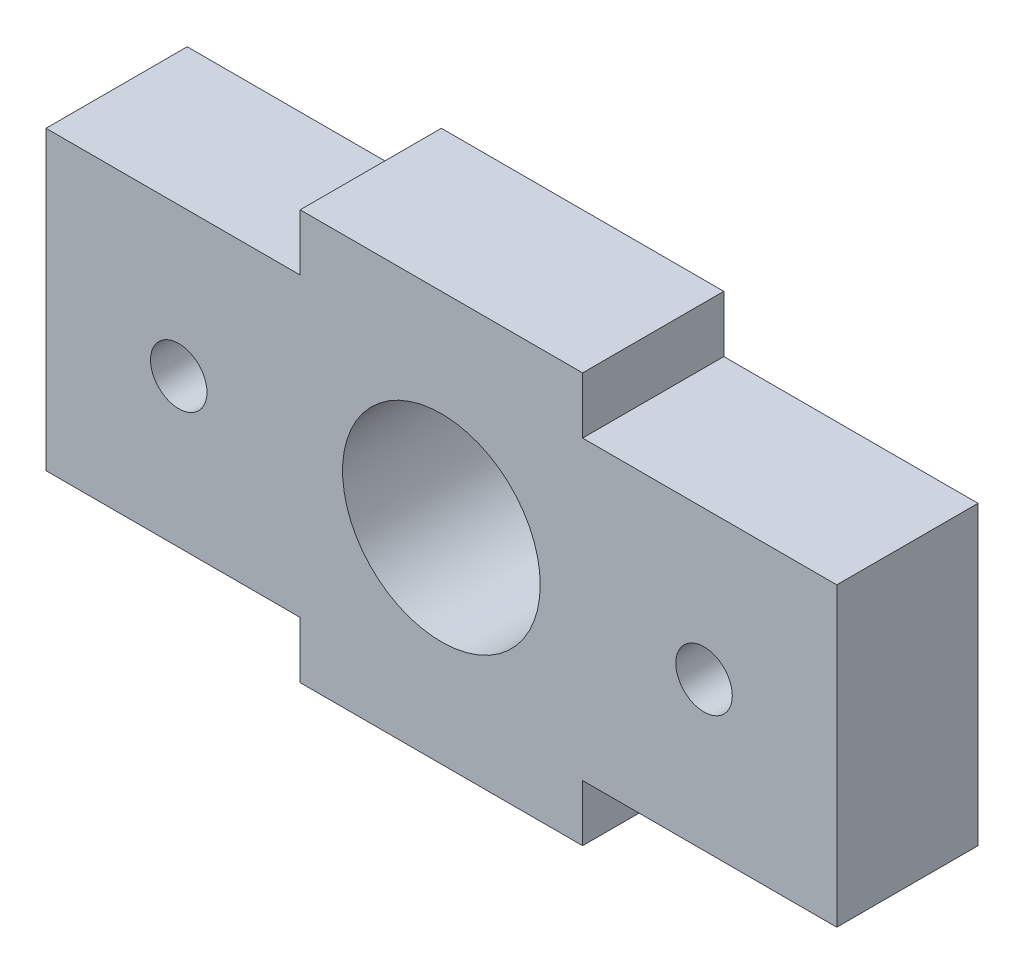
ISO-10303-21;
HEADER;
FILE_DESCRIPTION(('STEP AP214'),'2;1');
FILE_NAME('part.step','',(''),(''),'','','');
FILE_SCHEMA(('AUTOMOTIVE_DESIGN { 1 0 10303 214 1 1 1 1 }'));
ENDSEC;
DATA;
#1=APPLICATION_CONTEXT('core data for automotive mechanical design processes');
#2=APPLICATION_PROTOCOL_DEFINITION('international standard','automotive_design',2000,#1);
#3=PRODUCT_CONTEXT('',#1,'mechanical');
#4=PRODUCT('Part','Part','',(#3));
#5=PRODUCT_RELATED_PRODUCT_CATEGORY('part','',(#4));
#6=PRODUCT_DEFINITION_FORMATION('','',#4);
#7=PRODUCT_DEFINITION_CONTEXT('part definition',#1,'design');
#8=PRODUCT_DEFINITION('design','',#6,#7);
#9=PRODUCT_DEFINITION_SHAPE('','',#8);
#10=(LENGTH_UNIT() NAMED_UNIT(*) SI_UNIT(.MILLI.,.METRE.));
#11=(NAMED_UNIT(*) PLANE_ANGLE_UNIT() SI_UNIT($,.RADIAN.));
#12=(NAMED_UNIT(*) SI_UNIT($,.STERADIAN.) SOLID_ANGLE_UNIT());
#13=UNCERTAINTY_MEASURE_WITH_UNIT(LENGTH_MEASURE(1.E-05),#10,'distance_accuracy_value','');
#14=(GEOMETRIC_REPRESENTATION_CONTEXT(3) GLOBAL_UNCERTAINTY_ASSIGNED_CONTEXT((#13)) GLOBAL_UNIT_ASSIGNED_CONTEXT((#10,
#11,#12)) REPRESENTATION_CONTEXT('',''));
#15=CARTESIAN_POINT('',(0.,0.,0.));
#16=DIRECTION('',(0.,0.,1.));
#17=DIRECTION('',(1.,0.,0.));
#18=AXIS2_PLACEMENT_3D('',#15,#16,#17);
#19=CARTESIAN_POINT('',(0.,-5.25,5.));
#20=DIRECTION('',(0.,1.,0.));
#21=DIRECTION('',(-1.,0.,0.));
#22=AXIS2_PLACEMENT_3D('',#19,#20,#21);
#23=PLANE('',#22);
#24=DIRECTION('',(1.,0.,0.));
#25=VECTOR('',#24,1.);
#26=CARTESIAN_POINT('',(0.,-5.25,0.));
#27=LINE('',#26,#25);
#28=CARTESIAN_POINT('',(-14.,-5.25,0.));
#29=VERTEX_POINT('',#28);
#30=CARTESIAN_POINT('',(-5.,-5.25,0.));
#31=VERTEX_POINT('',#30);
#32=EDGE_CURVE('E223',#29,#31,#27,.T.);
#33=ORIENTED_EDGE('',*,*,#32,.T.);
#34=DIRECTION('',(0.,0.,-1.));
#35=VECTOR('',#34,1.);
#36=CARTESIAN_POINT('',(-5.,-5.25,5.));
#37=LINE('',#36,#35);
#38=CARTESIAN_POINT('',(-5.,-5.25,5.));
#39=VERTEX_POINT('',#38);
#40=EDGE_CURVE('E11',#39,#31,#37,.T.);
#41=ORIENTED_EDGE('',*,*,#40,.F.);
#42=DIRECTION('',(1.,0.,0.));
#43=VECTOR('',#42,1.);
#44=CARTESIAN_POINT('',(0.,-5.25,5.));
#45=LINE('',#44,#43);
#46=CARTESIAN_POINT('',(-14.,-5.25,5.));
#47=VERTEX_POINT('',#46);
#48=EDGE_CURVE('E171',#47,#39,#45,.T.);
#49=ORIENTED_EDGE('',*,*,#48,.F.);
#50=DIRECTION('',(0.,0.,-1.));
#51=VECTOR('',#50,1.);
#52=CARTESIAN_POINT('',(-14.,-5.25,5.));
#53=LINE('',#52,#51);
#54=EDGE_CURVE('E52',#47,#29,#53,.T.);
#55=ORIENTED_EDGE('',*,*,#54,.T.);
#56=EDGE_LOOP('',(#33,#41,#49,#55));
#57=FACE_BOUND('',#56,.T.);
#58=ADVANCED_FACE('F35',(#57),#23,.F.);
#59=CARTESIAN_POINT('',(-4.99999999999992,0.,5.));
#60=DIRECTION('',(1.,0.,0.));
#61=DIRECTION('',(0.,1.,0.));
#62=AXIS2_PLACEMENT_3D('',#59,#60,#61);
#63=PLANE('',#62);
#64=DIRECTION('',(0.,-1.,0.));
#65=VECTOR('',#64,1.);
#66=CARTESIAN_POINT('',(-4.99999999999992,0.,0.));
#67=LINE('',#66,#65);
#68=CARTESIAN_POINT('',(-5.00000000000001,-7.25,0.));
#69=VERTEX_POINT('',#68);
#70=EDGE_CURVE('E217',#31,#69,#67,.T.);
#71=ORIENTED_EDGE('',*,*,#70,.T.);
#72=DIRECTION('',(0.,0.,-1.));
#73=VECTOR('',#72,1.);
#74=CARTESIAN_POINT('',(-5.00000000000001,-7.25,5.));
#75=LINE('',#74,#73);
#76=CARTESIAN_POINT('',(-5.00000000000001,-7.25,5.));
#77=VERTEX_POINT('',#76);
#78=EDGE_CURVE('E44',#77,#69,#75,.T.);
#79=ORIENTED_EDGE('',*,*,#78,.F.);
#80=DIRECTION('',(0.,-1.,0.));
#81=VECTOR('',#80,1.);
#82=CARTESIAN_POINT('',(-4.99999999999992,0.,5.));
#83=LINE('',#82,#81);
#84=EDGE_CURVE('E102',#39,#77,#83,.T.);
#85=ORIENTED_EDGE('',*,*,#84,.F.);
#86=ORIENTED_EDGE('',*,*,#40,.T.);
#87=EDGE_LOOP('',(#71,#79,#85,#86));
#88=FACE_BOUND('',#87,.T.);
#89=ADVANCED_FACE('F37',(#88),#63,.F.);
#90=CARTESIAN_POINT('',(0.,-7.25,5.));
#91=DIRECTION('',(0.,1.,0.));
#92=DIRECTION('',(-1.,0.,0.));
#93=AXIS2_PLACEMENT_3D('',#90,#91,#92);
#94=PLANE('',#93);
#95=DIRECTION('',(1.,0.,0.));
#96=VECTOR('',#95,1.);
#97=CARTESIAN_POINT('',(0.,-7.25,0.));
#98=LINE('',#97,#96);
#99=CARTESIAN_POINT('',(5.00000000000001,-7.25,0.));
#100=VERTEX_POINT('',#99);
#101=EDGE_CURVE('E212',#69,#100,#98,.T.);
#102=ORIENTED_EDGE('',*,*,#101,.T.);
#103=DIRECTION('',(0.,0.,-1.));
#104=VECTOR('',#103,1.);
#105=CARTESIAN_POINT('',(5.00000000000001,-7.25,5.));
#106=LINE('',#105,#104);
#107=CARTESIAN_POINT('',(5.00000000000001,-7.25,5.));
#108=VERTEX_POINT('',#107);
#109=EDGE_CURVE('E204',#108,#100,#106,.T.);
#110=ORIENTED_EDGE('',*,*,#109,.F.);
#111=DIRECTION('',(1.,0.,0.));
#112=VECTOR('',#111,1.);
#113=CARTESIAN_POINT('',(0.,-7.25,5.));
#114=LINE('',#113,#112);
#115=EDGE_CURVE('E174',#77,#108,#114,.T.);
#116=ORIENTED_EDGE('',*,*,#115,.F.);
#117=ORIENTED_EDGE('',*,*,#78,.T.);
#118=EDGE_LOOP('',(#102,#110,#116,#117));
#119=FACE_BOUND('',#118,.T.);
#120=ADVANCED_FACE('F210',(#119),#94,.F.);
#121=CARTESIAN_POINT('',(4.99999999999992,0.,5.));
#122=DIRECTION('',(-1.,0.,0.));
#123=DIRECTION('',(0.,-1.,0.));
#124=AXIS2_PLACEMENT_3D('',#121,#122,#123);
#125=PLANE('',#124);
#126=DIRECTION('',(0.,1.,0.));
#127=VECTOR('',#126,1.);
#128=CARTESIAN_POINT('',(4.99999999999992,0.,0.));
#129=LINE('',#128,#127);
#130=CARTESIAN_POINT('',(5.,-5.25,0.));
#131=VERTEX_POINT('',#130);
#132=EDGE_CURVE('E219',#100,#131,#129,.T.);
#133=ORIENTED_EDGE('',*,*,#132,.T.);
#134=DIRECTION('',(0.,0.,-1.));
#135=VECTOR('',#134,1.);
#136=CARTESIAN_POINT('',(5.,-5.25,5.));
#137=LINE('',#136,#135);
#138=CARTESIAN_POINT('',(5.,-5.25,5.));
#139=VERTEX_POINT('',#138);
#140=EDGE_CURVE('E201',#139,#131,#137,.T.);
#141=ORIENTED_EDGE('',*,*,#140,.F.);
#142=DIRECTION('',(0.,1.,0.));
#143=VECTOR('',#142,1.);
#144=CARTESIAN_POINT('',(4.99999999999992,0.,5.));
#145=LINE('',#144,#143);
#146=EDGE_CURVE('E169',#108,#139,#145,.T.);
#147=ORIENTED_EDGE('',*,*,#146,.F.);
#148=ORIENTED_EDGE('',*,*,#109,.T.);
#149=EDGE_LOOP('',(#133,#141,#147,#148));
#150=FACE_BOUND('',#149,.T.);
#151=ADVANCED_FACE('F272',(#150),#125,.F.);
#152=CARTESIAN_POINT('',(14.,-5.25,0.));
#153=VERTEX_POINT('',#152);
#154=EDGE_CURVE('E221',#131,#153,#27,.T.);
#155=ORIENTED_EDGE('',*,*,#154,.T.);
#156=DIRECTION('',(0.,0.,-1.));
#157=VECTOR('',#156,1.);
#158=CARTESIAN_POINT('',(14.,-5.25,5.));
#159=LINE('',#158,#157);
#160=CARTESIAN_POINT('',(14.,-5.25,5.));
#161=VERTEX_POINT('',#160);
#162=EDGE_CURVE('E198',#161,#153,#159,.T.);
#163=ORIENTED_EDGE('',*,*,#162,.F.);
#164=EDGE_CURVE('E166',#139,#161,#45,.T.);
#165=ORIENTED_EDGE('',*,*,#164,.F.);
#166=ORIENTED_EDGE('',*,*,#140,.T.);
#167=EDGE_LOOP('',(#155,#163,#165,#166));
#168=FACE_BOUND('',#167,.T.);
#169=ADVANCED_FACE('F264',(#168),#23,.F.);
#170=CARTESIAN_POINT('',(14.,0.,5.));
#171=DIRECTION('',(-1.,0.,0.));
#172=DIRECTION('',(0.,-1.,0.));
#173=AXIS2_PLACEMENT_3D('',#170,#171,#172);
#174=PLANE('',#173);
#175=DIRECTION('',(0.,1.,0.));
#176=VECTOR('',#175,1.);
#177=CARTESIAN_POINT('',(14.,0.,0.));
#178=LINE('',#177,#176);
#179=CARTESIAN_POINT('',(14.,5.25,0.));
#180=VERTEX_POINT('',#179);
#181=EDGE_CURVE('E227',#153,#180,#178,.T.);
#182=ORIENTED_EDGE('',*,*,#181,.T.);
#183=DIRECTION('',(0.,0.,-1.));
#184=VECTOR('',#183,1.);
#185=CARTESIAN_POINT('',(14.,5.25,5.));
#186=LINE('',#185,#184);
#187=CARTESIAN_POINT('',(14.,5.25,5.));
#188=VERTEX_POINT('',#187);
#189=EDGE_CURVE('E196',#188,#180,#186,.T.);
#190=ORIENTED_EDGE('',*,*,#189,.F.);
#191=DIRECTION('',(0.,1.,0.));
#192=VECTOR('',#191,1.);
#193=CARTESIAN_POINT('',(14.,0.,5.));
#194=LINE('',#193,#192);
#195=EDGE_CURVE('E162',#161,#188,#194,.T.);
#196=ORIENTED_EDGE('',*,*,#195,.F.);
#197=ORIENTED_EDGE('',*,*,#162,.T.);
#198=EDGE_LOOP('',(#182,#190,#196,#197));
#199=FACE_BOUND('',#198,.T.);
#200=ADVANCED_FACE('F271',(#199),#174,.F.);
#201=CARTESIAN_POINT('',(0.,5.25,5.));
#202=DIRECTION('',(0.,1.,0.));
#203=DIRECTION('',(-1.,0.,0.));
#204=AXIS2_PLACEMENT_3D('',#201,#202,#203);
#205=PLANE('',#204);
#206=DIRECTION('',(1.,0.,0.));
#207=VECTOR('',#206,1.);
#208=CARTESIAN_POINT('',(0.,5.25,0.));
#209=LINE('',#208,#207);
#210=CARTESIAN_POINT('',(5.,5.25,0.));
#211=VERTEX_POINT('',#210);
#212=EDGE_CURVE('E230',#211,#180,#209,.T.);
#213=ORIENTED_EDGE('',*,*,#212,.F.);
#214=DIRECTION('',(0.,0.,-1.));
#215=VECTOR('',#214,1.);
#216=CARTESIAN_POINT('',(5.,5.25,5.));
#217=LINE('',#216,#215);
#218=CARTESIAN_POINT('',(5.,5.25,5.));
#219=VERTEX_POINT('',#218);
#220=EDGE_CURVE('E194',#219,#211,#217,.T.);
#221=ORIENTED_EDGE('',*,*,#220,.F.);
#222=DIRECTION('',(1.,0.,0.));
#223=VECTOR('',#222,1.);
#224=CARTESIAN_POINT('',(0.,5.25,5.));
#225=LINE('',#224,#223);
#226=EDGE_CURVE('E155',#219,#188,#225,.T.);
#227=ORIENTED_EDGE('',*,*,#226,.T.);
#228=ORIENTED_EDGE('',*,*,#189,.T.);
#229=EDGE_LOOP('',(#213,#221,#227,#228));
#230=FACE_BOUND('',#229,.T.);
#231=ADVANCED_FACE('F278',(#230),#205,.T.);
#232=CARTESIAN_POINT('',(4.99999999999992,0.,5.));
#233=DIRECTION('',(1.,0.,0.));
#234=DIRECTION('',(0.,1.,0.));
#235=AXIS2_PLACEMENT_3D('',#232,#233,#234);
#236=PLANE('',#235);
#237=DIRECTION('',(0.,-1.,0.));
#238=VECTOR('',#237,1.);
#239=CARTESIAN_POINT('',(4.99999999999992,0.,0.));
#240=LINE('',#239,#238);
#241=CARTESIAN_POINT('',(5.00000000000001,7.25,0.));
#242=VERTEX_POINT('',#241);
#243=EDGE_CURVE('E233',#242,#211,#240,.T.);
#244=ORIENTED_EDGE('',*,*,#243,.F.);
#245=DIRECTION('',(0.,0.,-1.));
#246=VECTOR('',#245,1.);
#247=CARTESIAN_POINT('',(5.00000000000001,7.25,5.));
#248=LINE('',#247,#246);
#249=CARTESIAN_POINT('',(5.00000000000001,7.25,5.));
#250=VERTEX_POINT('',#249);
#251=EDGE_CURVE('E192',#250,#242,#248,.T.);
#252=ORIENTED_EDGE('',*,*,#251,.F.);
#253=DIRECTION('',(0.,-1.,0.));
#254=VECTOR('',#253,1.);
#255=CARTESIAN_POINT('',(4.99999999999992,0.,5.));
#256=LINE('',#255,#254);
#257=EDGE_CURVE('E161',#250,#219,#256,.T.);
#258=ORIENTED_EDGE('',*,*,#257,.T.);
#259=ORIENTED_EDGE('',*,*,#220,.T.);
#260=EDGE_LOOP('',(#244,#252,#258,#259));
#261=FACE_BOUND('',#260,.T.);
#262=ADVANCED_FACE('F288',(#261),#236,.T.);
#263=CARTESIAN_POINT('',(0.,7.25,5.));
#264=DIRECTION('',(0.,1.,0.));
#265=DIRECTION('',(-1.,0.,0.));
#266=AXIS2_PLACEMENT_3D('',#263,#264,#265);
#267=PLANE('',#266);
#268=DIRECTION('',(1.,0.,0.));
#269=VECTOR('',#268,1.);
#270=CARTESIAN_POINT('',(0.,7.25,0.));
#271=LINE('',#270,#269);
#272=CARTESIAN_POINT('',(-4.99999999999999,7.25,0.));
#273=VERTEX_POINT('',#272);
#274=EDGE_CURVE('E237',#273,#242,#271,.T.);
#275=ORIENTED_EDGE('',*,*,#274,.F.);
#276=DIRECTION('',(0.,0.,-1.));
#277=VECTOR('',#276,1.);
#278=CARTESIAN_POINT('',(-4.99999999999999,7.25,5.));
#279=LINE('',#278,#277);
#280=CARTESIAN_POINT('',(-4.99999999999999,7.25,5.));
#281=VERTEX_POINT('',#280);
#282=EDGE_CURVE('E139',#281,#273,#279,.T.);
#283=ORIENTED_EDGE('',*,*,#282,.F.);
#284=DIRECTION('',(1.,0.,0.));
#285=VECTOR('',#284,1.);
#286=CARTESIAN_POINT('',(0.,7.25,5.));
#287=LINE('',#286,#285);
#288=EDGE_CURVE('E150',#281,#250,#287,.T.);
#289=ORIENTED_EDGE('',*,*,#288,.T.);
#290=ORIENTED_EDGE('',*,*,#251,.T.);
#291=EDGE_LOOP('',(#275,#283,#289,#290));
#292=FACE_BOUND('',#291,.T.);
#293=ADVANCED_FACE('F291',(#292),#267,.T.);
#294=CARTESIAN_POINT('',(-4.99999999999999,0.,5.));
#295=DIRECTION('',(-1.,0.,0.));
#296=DIRECTION('',(0.,0.,1.));
#297=AXIS2_PLACEMENT_3D('',#294,#295,#296);
#298=PLANE('',#297);
#299=DIRECTION('',(0.,1.,0.));
#300=VECTOR('',#299,1.);
#301=CARTESIAN_POINT('',(-4.99999999999999,0.,0.));
#302=LINE('',#301,#300);
#303=CARTESIAN_POINT('',(-4.99999999999999,5.25,0.));
#304=VERTEX_POINT('',#303);
#305=EDGE_CURVE('E135',#304,#273,#302,.T.);
#306=ORIENTED_EDGE('',*,*,#305,.F.);
#307=DIRECTION('',(0.,0.,-1.));
#308=VECTOR('',#307,1.);
#309=CARTESIAN_POINT('',(-4.99999999999999,5.25,5.));
#310=LINE('',#309,#308);
#311=CARTESIAN_POINT('',(-4.99999999999999,5.25,5.));
#312=VERTEX_POINT('',#311);
#313=EDGE_CURVE('E130',#312,#304,#310,.T.);
#314=ORIENTED_EDGE('',*,*,#313,.F.);
#315=DIRECTION('',(0.,1.,0.));
#316=VECTOR('',#315,1.);
#317=CARTESIAN_POINT('',(-4.99999999999999,0.,5.));
#318=LINE('',#317,#316);
#319=EDGE_CURVE('E133',#312,#281,#318,.T.);
#320=ORIENTED_EDGE('',*,*,#319,.T.);
#321=ORIENTED_EDGE('',*,*,#282,.T.);
#322=EDGE_LOOP('',(#306,#314,#320,#321));
#323=FACE_BOUND('',#322,.T.);
#324=ADVANCED_FACE('F132',(#323),#298,.T.);
#325=CARTESIAN_POINT('',(-14.,5.25,0.));
#326=VERTEX_POINT('',#325);
#327=EDGE_CURVE('E234',#326,#304,#209,.T.);
#328=ORIENTED_EDGE('',*,*,#327,.F.);
#329=DIRECTION('',(0.,0.,-1.));
#330=VECTOR('',#329,1.);
#331=CARTESIAN_POINT('',(-14.,5.25,5.));
#332=LINE('',#331,#330);
#333=CARTESIAN_POINT('',(-14.,5.25,5.));
#334=VERTEX_POINT('',#333);
#335=EDGE_CURVE('E90',#334,#326,#332,.T.);
#336=ORIENTED_EDGE('',*,*,#335,.F.);
#337=EDGE_CURVE('E147',#334,#312,#225,.T.);
#338=ORIENTED_EDGE('',*,*,#337,.T.);
#339=ORIENTED_EDGE('',*,*,#313,.T.);
#340=EDGE_LOOP('',(#328,#336,#338,#339));
#341=FACE_BOUND('',#340,.T.);
#342=ADVANCED_FACE('F152',(#341),#205,.T.);
#343=CARTESIAN_POINT('',(9.3,0.,5.));
#344=DIRECTION('',(0.,0.,-1.));
#345=DIRECTION('',(-1.,0.,0.));
#346=AXIS2_PLACEMENT_3D('',#343,#344,#345);
#347=CYLINDRICAL_SURFACE('',#346,1.);
#348=CARTESIAN_POINT('',(9.3,0.,5.));
#349=DIRECTION('',(0.,0.,1.));
#350=DIRECTION('',(1.,0.,0.));
#351=AXIS2_PLACEMENT_3D('',#348,#349,#350);
#352=CIRCLE('',#351,1.);
#353=CARTESIAN_POINT('',(10.3,0.,5.));
#354=VERTEX_POINT('',#353);
#355=EDGE_CURVE('E295',#354,#354,#352,.T.);
#356=ORIENTED_EDGE('',*,*,#355,.T.);
#357=EDGE_LOOP('',(#356));
#358=FACE_BOUND('',#357,.T.);
#359=CARTESIAN_POINT('',(9.3,0.,0.));
#360=DIRECTION('',(0.,0.,1.));
#361=DIRECTION('',(1.,0.,0.));
#362=AXIS2_PLACEMENT_3D('',#359,#360,#361);
#363=CIRCLE('',#362,1.);
#364=CARTESIAN_POINT('',(10.3,0.,0.));
#365=VERTEX_POINT('',#364);
#366=EDGE_CURVE('E179',#365,#365,#363,.T.);
#367=ORIENTED_EDGE('',*,*,#366,.F.);
#368=EDGE_LOOP('',(#367));
#369=FACE_BOUND('',#368,.T.);
#370=ADVANCED_FACE('F250',(#358,#369),#347,.F.);
#371=CARTESIAN_POINT('',(0.,0.,5.));
#372=DIRECTION('',(0.,0.,-1.));
#373=DIRECTION('',(-1.,0.,0.));
#374=AXIS2_PLACEMENT_3D('',#371,#372,#373);
#375=CYLINDRICAL_SURFACE('',#374,3.5);
#376=CARTESIAN_POINT('',(0.,0.,5.));
#377=DIRECTION('',(0.,0.,1.));
#378=DIRECTION('',(1.,0.,0.));
#379=AXIS2_PLACEMENT_3D('',#376,#377,#378);
#380=CIRCLE('',#379,3.5);
#381=CARTESIAN_POINT('',(3.5,0.,5.));
#382=VERTEX_POINT('',#381);
#383=EDGE_CURVE('E156',#382,#382,#380,.T.);
#384=ORIENTED_EDGE('',*,*,#383,.T.);
#385=EDGE_LOOP('',(#384));
#386=FACE_BOUND('',#385,.T.);
#387=CARTESIAN_POINT('',(0.,0.,0.));
#388=DIRECTION('',(0.,0.,1.));
#389=DIRECTION('',(1.,0.,0.));
#390=AXIS2_PLACEMENT_3D('',#387,#388,#389);
#391=CIRCLE('',#390,3.5);
#392=CARTESIAN_POINT('',(3.5,0.,0.));
#393=VERTEX_POINT('',#392);
#394=EDGE_CURVE('E184',#393,#393,#391,.T.);
#395=ORIENTED_EDGE('',*,*,#394,.F.);
#396=EDGE_LOOP('',(#395));
#397=FACE_BOUND('',#396,.T.);
#398=ADVANCED_FACE('F247',(#386,#397),#375,.F.);
#399=CARTESIAN_POINT('',(-14.,0.,5.));
#400=DIRECTION('',(-1.,0.,0.));
#401=DIRECTION('',(0.,-1.,0.));
#402=AXIS2_PLACEMENT_3D('',#399,#400,#401);
#403=PLANE('',#402);
#404=DIRECTION('',(0.,1.,0.));
#405=VECTOR('',#404,1.);
#406=CARTESIAN_POINT('',(-14.,0.,0.));
#407=LINE('',#406,#405);
#408=EDGE_CURVE('E241',#29,#326,#407,.T.);
#409=ORIENTED_EDGE('',*,*,#408,.F.);
#410=ORIENTED_EDGE('',*,*,#54,.F.);
#411=DIRECTION('',(0.,1.,0.));
#412=VECTOR('',#411,1.);
#413=CARTESIAN_POINT('',(-14.,0.,5.));
#414=LINE('',#413,#412);
#415=EDGE_CURVE('E153',#47,#334,#414,.T.);
#416=ORIENTED_EDGE('',*,*,#415,.T.);
#417=ORIENTED_EDGE('',*,*,#335,.T.);
#418=EDGE_LOOP('',(#409,#410,#416,#417));
#419=FACE_BOUND('',#418,.T.);
#420=ADVANCED_FACE('F249',(#419),#403,.T.);
#421=CARTESIAN_POINT('',(-9.3,0.,5.));
#422=DIRECTION('',(0.,0.,-1.));
#423=DIRECTION('',(-1.,0.,0.));
#424=AXIS2_PLACEMENT_3D('',#421,#422,#423);
#425=CYLINDRICAL_SURFACE('',#424,0.999999999999998);
#426=CARTESIAN_POINT('',(-9.3,0.,5.));
#427=DIRECTION('',(0.,0.,1.));
#428=DIRECTION('',(1.,0.,0.));
#429=AXIS2_PLACEMENT_3D('',#426,#427,#428);
#430=CIRCLE('',#429,0.999999999999998);
#431=CARTESIAN_POINT('',(-8.3,0.,5.));
#432=VERTEX_POINT('',#431);
#433=EDGE_CURVE('E189',#432,#432,#430,.F.);
#434=ORIENTED_EDGE('',*,*,#433,.F.);
#435=EDGE_LOOP('',(#434));
#436=FACE_BOUND('',#435,.T.);
#437=CARTESIAN_POINT('',(-9.3,0.,0.));
#438=DIRECTION('',(0.,0.,1.));
#439=DIRECTION('',(1.,0.,0.));
#440=AXIS2_PLACEMENT_3D('',#437,#438,#439);
#441=CIRCLE('',#440,0.999999999999998);
#442=CARTESIAN_POINT('',(-8.3,0.,0.));
#443=VERTEX_POINT('',#442);
#444=EDGE_CURVE('E176',#443,#443,#441,.F.);
#445=ORIENTED_EDGE('',*,*,#444,.T.);
#446=EDGE_LOOP('',(#445));
#447=FACE_BOUND('',#446,.T.);
#448=ADVANCED_FACE('F257',(#436,#447),#425,.F.);
#449=CARTESIAN_POINT('',(0.,0.,5.));
#450=DIRECTION('',(0.,0.,1.));
#451=DIRECTION('',(1.,0.,0.));
#452=AXIS2_PLACEMENT_3D('',#449,#450,#451);
#453=PLANE('',#452);
#454=ORIENTED_EDGE('',*,*,#48,.T.);
#455=ORIENTED_EDGE('',*,*,#84,.T.);
#456=ORIENTED_EDGE('',*,*,#115,.T.);
#457=ORIENTED_EDGE('',*,*,#146,.T.);
#458=ORIENTED_EDGE('',*,*,#164,.T.);
#459=ORIENTED_EDGE('',*,*,#195,.T.);
#460=ORIENTED_EDGE('',*,*,#226,.F.);
#461=ORIENTED_EDGE('',*,*,#257,.F.);
#462=ORIENTED_EDGE('',*,*,#288,.F.);
#463=ORIENTED_EDGE('',*,*,#319,.F.);
#464=ORIENTED_EDGE('',*,*,#337,.F.);
#465=ORIENTED_EDGE('',*,*,#415,.F.);
#466=EDGE_LOOP('',(#454,#455,#456,#457,#458,#459,#460,#461,#462,#463,#464,#465));
#467=FACE_BOUND('',#466,.T.);
#468=ORIENTED_EDGE('',*,*,#383,.F.);
#469=EDGE_LOOP('',(#468));
#470=FACE_BOUND('',#469,.T.);
#471=ORIENTED_EDGE('',*,*,#355,.F.);
#472=EDGE_LOOP('',(#471));
#473=FACE_BOUND('',#472,.T.);
#474=ORIENTED_EDGE('',*,*,#433,.T.);
#475=EDGE_LOOP('',(#474));
#476=FACE_BOUND('',#475,.T.);
#477=ADVANCED_FACE('F144',(#467,#470,#473,#476),#453,.T.);
#478=CARTESIAN_POINT('',(0.,0.,0.));
#479=DIRECTION('',(0.,0.,1.));
#480=DIRECTION('',(1.,0.,0.));
#481=AXIS2_PLACEMENT_3D('',#478,#479,#480);
#482=PLANE('',#481);
#483=ORIENTED_EDGE('',*,*,#32,.F.);
#484=ORIENTED_EDGE('',*,*,#408,.T.);
#485=ORIENTED_EDGE('',*,*,#327,.T.);
#486=ORIENTED_EDGE('',*,*,#305,.T.);
#487=ORIENTED_EDGE('',*,*,#274,.T.);
#488=ORIENTED_EDGE('',*,*,#243,.T.);
#489=ORIENTED_EDGE('',*,*,#212,.T.);
#490=ORIENTED_EDGE('',*,*,#181,.F.);
#491=ORIENTED_EDGE('',*,*,#154,.F.);
#492=ORIENTED_EDGE('',*,*,#132,.F.);
#493=ORIENTED_EDGE('',*,*,#101,.F.);
#494=ORIENTED_EDGE('',*,*,#70,.F.);
#495=EDGE_LOOP('',(#483,#484,#485,#486,#487,#488,#489,#490,#491,#492,#493,#494));
#496=FACE_BOUND('',#495,.T.);
#497=ORIENTED_EDGE('',*,*,#394,.T.);
#498=EDGE_LOOP('',(#497));
#499=FACE_BOUND('',#498,.T.);
#500=ORIENTED_EDGE('',*,*,#366,.T.);
#501=EDGE_LOOP('',(#500));
#502=FACE_BOUND('',#501,.T.);
#503=ORIENTED_EDGE('',*,*,#444,.F.);
#504=EDGE_LOOP('',(#503));
#505=FACE_BOUND('',#504,.T.);
#506=ADVANCED_FACE('F215',(#496,#499,#502,#505),#482,.F.);
#507=CLOSED_SHELL('',(#58,#89,#120,#151,#169,#200,#231,#262,#293,#324,#342,#370,#398,#420,#448,
#477,#506));
#508=MANIFOLD_SOLID_BREP('B2',#507);
#509=ADVANCED_BREP_SHAPE_REPRESENTATION('',(#18,#508),#14);
#510=SHAPE_DEFINITION_REPRESENTATION(#9,#509);
ENDSEC;
END-ISO-10303-21;
